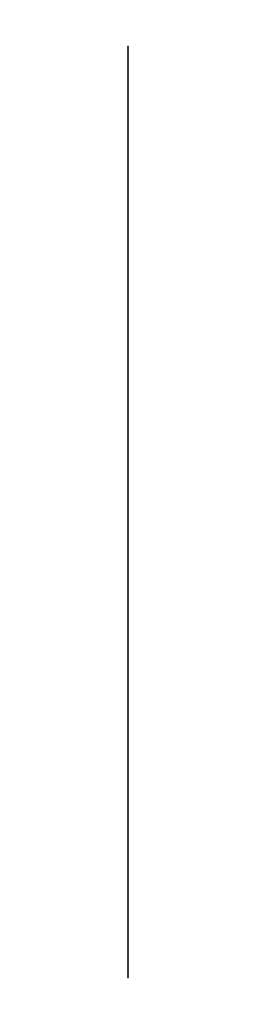
ISO-10303-21;
HEADER;
FILE_DESCRIPTION(('STEP AP214'),'2;1');
FILE_NAME('part.step','',(''),(''),'','','');
FILE_SCHEMA(('AUTOMOTIVE_DESIGN { 1 0 10303 214 1 1 1 1 }'));
ENDSEC;
DATA;
#1=APPLICATION_CONTEXT('core data for automotive mechanical design processes');
#2=APPLICATION_PROTOCOL_DEFINITION('international standard','automotive_design',2000,#1);
#3=PRODUCT_CONTEXT('',#1,'mechanical');
#4=PRODUCT('Part','Part','',(#3));
#5=PRODUCT_RELATED_PRODUCT_CATEGORY('part','',(#4));
#6=PRODUCT_DEFINITION_FORMATION('','',#4);
#7=PRODUCT_DEFINITION_CONTEXT('part definition',#1,'design');
#8=PRODUCT_DEFINITION('design','',#6,#7);
#9=PRODUCT_DEFINITION_SHAPE('','',#8);
#10=(LENGTH_UNIT() NAMED_UNIT(*) SI_UNIT(.MILLI.,.METRE.));
#11=(NAMED_UNIT(*) PLANE_ANGLE_UNIT() SI_UNIT($,.RADIAN.));
#12=(NAMED_UNIT(*) SI_UNIT($,.STERADIAN.) SOLID_ANGLE_UNIT());
#13=UNCERTAINTY_MEASURE_WITH_UNIT(LENGTH_MEASURE(1.E-05),#10,'distance_accuracy_value','');
#14=(GEOMETRIC_REPRESENTATION_CONTEXT(3) GLOBAL_UNCERTAINTY_ASSIGNED_CONTEXT((#13)) GLOBAL_UNIT_ASSIGNED_CONTEXT((#10,
#11,#12)) REPRESENTATION_CONTEXT('',''));
#15=CARTESIAN_POINT('',(0.,0.,0.));
#16=DIRECTION('',(0.,0.,1.));
#17=DIRECTION('',(1.,0.,0.));
#18=AXIS2_PLACEMENT_3D('',#15,#16,#17);
#19=CARTESIAN_POINT('',(0.,2000.,0.));
#20=DIRECTION('',(0.,-1.,0.));
#21=DIRECTION('',(0.,0.,-1.));
#22=AXIS2_PLACEMENT_3D('',#19,#20,#21);
#23=CYLINDRICAL_SURFACE('',#22,0.999999999999999);
#24=CARTESIAN_POINT('',(0.,2000.,0.));
#25=DIRECTION('',(0.,1.,0.));
#26=DIRECTION('',(0.,0.,1.));
#27=AXIS2_PLACEMENT_3D('',#24,#25,#26);
#28=CIRCLE('',#27,0.999999999999999);
#29=CARTESIAN_POINT('',(0.,2000.,0.999999999999999));
#30=VERTEX_POINT('',#29);
#31=EDGE_CURVE('E10',#30,#30,#28,.T.);
#32=ORIENTED_EDGE('',*,*,#31,.F.);
#33=EDGE_LOOP('',(#32));
#34=FACE_BOUND('',#33,.T.);
#35=CARTESIAN_POINT('',(0.,0.,0.));
#36=DIRECTION('',(0.,1.,0.));
#37=DIRECTION('',(0.,0.,1.));
#38=AXIS2_PLACEMENT_3D('',#35,#36,#37);
#39=CIRCLE('',#38,0.999999999999999);
#40=CARTESIAN_POINT('',(0.,0.,0.999999999999999));
#41=VERTEX_POINT('',#40);
#42=EDGE_CURVE('E39',#41,#41,#39,.T.);
#43=ORIENTED_EDGE('',*,*,#42,.T.);
#44=EDGE_LOOP('',(#43));
#45=FACE_BOUND('',#44,.T.);
#46=ADVANCED_FACE('F36',(#34,#45),#23,.T.);
#47=CARTESIAN_POINT('',(0.,2000.,0.));
#48=DIRECTION('',(0.,1.,0.));
#49=DIRECTION('',(0.,0.,1.));
#50=AXIS2_PLACEMENT_3D('',#47,#48,#49);
#51=PLANE('',#50);
#52=ORIENTED_EDGE('',*,*,#31,.T.);
#53=EDGE_LOOP('',(#52));
#54=FACE_BOUND('',#53,.T.);
#55=ADVANCED_FACE('F51',(#54),#51,.T.);
#56=CARTESIAN_POINT('',(0.,0.,0.));
#57=DIRECTION('',(0.,1.,0.));
#58=DIRECTION('',(0.,0.,1.));
#59=AXIS2_PLACEMENT_3D('',#56,#57,#58);
#60=PLANE('',#59);
#61=ORIENTED_EDGE('',*,*,#42,.F.);
#62=EDGE_LOOP('',(#61));
#63=FACE_BOUND('',#62,.T.);
#64=ADVANCED_FACE('F49',(#63),#60,.F.);
#65=CLOSED_SHELL('',(#46,#55,#64));
#66=MANIFOLD_SOLID_BREP('B2',#65);
#67=ADVANCED_BREP_SHAPE_REPRESENTATION('',(#18,#66),#14);
#68=SHAPE_DEFINITION_REPRESENTATION(#9,#67);
ENDSEC;
END-ISO-10303-21;
